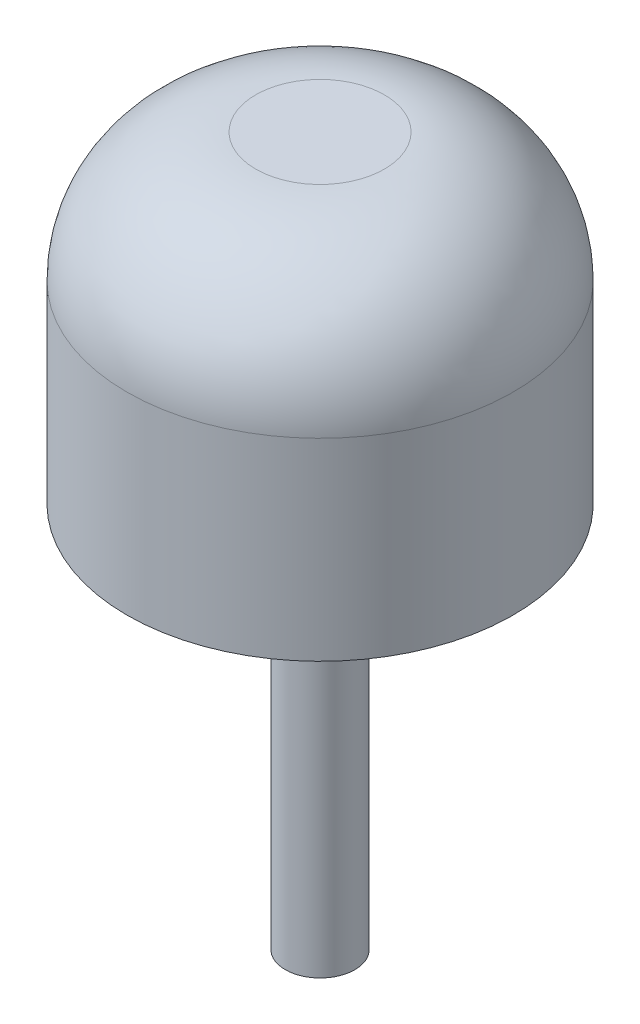
ISO-10303-21;
HEADER;
FILE_DESCRIPTION(('STEP AP214'),'2;1');
FILE_NAME('part.step','',(''),(''),'','','');
FILE_SCHEMA(('AUTOMOTIVE_DESIGN { 1 0 10303 214 1 1 1 1 }'));
ENDSEC;
DATA;
#1=APPLICATION_CONTEXT('core data for automotive mechanical design processes');
#2=APPLICATION_PROTOCOL_DEFINITION('international standard','automotive_design',2000,#1);
#3=PRODUCT_CONTEXT('',#1,'mechanical');
#4=PRODUCT('Part','Part','',(#3));
#5=PRODUCT_RELATED_PRODUCT_CATEGORY('part','',(#4));
#6=PRODUCT_DEFINITION_FORMATION('','',#4);
#7=PRODUCT_DEFINITION_CONTEXT('part definition',#1,'design');
#8=PRODUCT_DEFINITION('design','',#6,#7);
#9=PRODUCT_DEFINITION_SHAPE('','',#8);
#10=(LENGTH_UNIT() NAMED_UNIT(*) SI_UNIT(.MILLI.,.METRE.));
#11=(NAMED_UNIT(*) PLANE_ANGLE_UNIT() SI_UNIT($,.RADIAN.));
#12=(NAMED_UNIT(*) SI_UNIT($,.STERADIAN.) SOLID_ANGLE_UNIT());
#13=UNCERTAINTY_MEASURE_WITH_UNIT(LENGTH_MEASURE(1.E-05),#10,'distance_accuracy_value','');
#14=(GEOMETRIC_REPRESENTATION_CONTEXT(3) GLOBAL_UNCERTAINTY_ASSIGNED_CONTEXT((#13)) GLOBAL_UNIT_ASSIGNED_CONTEXT((#10,
#11,#12)) REPRESENTATION_CONTEXT('',''));
#15=CARTESIAN_POINT('',(0.,0.,0.));
#16=DIRECTION('',(0.,0.,1.));
#17=DIRECTION('',(1.,0.,0.));
#18=AXIS2_PLACEMENT_3D('',#15,#16,#17);
#19=CARTESIAN_POINT('',(0.,6.35,0.));
#20=DIRECTION('',(0.,-1.,0.));
#21=DIRECTION('',(0.,0.,-1.));
#22=AXIS2_PLACEMENT_3D('',#19,#20,#21);
#23=CYLINDRICAL_SURFACE('',#22,3.81);
#24=CARTESIAN_POINT('',(0.,3.81,0.));
#25=DIRECTION('',(0.,1.,0.));
#26=DIRECTION('',(0.,0.,1.));
#27=AXIS2_PLACEMENT_3D('',#24,#25,#26);
#28=CIRCLE('',#27,3.81);
#29=CARTESIAN_POINT('',(0.,3.81,3.81));
#30=VERTEX_POINT('',#29);
#31=EDGE_CURVE('E10',#30,#30,#28,.F.);
#32=ORIENTED_EDGE('',*,*,#31,.T.);
#33=EDGE_LOOP('',(#32));
#34=FACE_BOUND('',#33,.T.);
#35=CARTESIAN_POINT('',(0.,0.,0.));
#36=DIRECTION('',(0.,1.,0.));
#37=DIRECTION('',(0.,0.,1.));
#38=AXIS2_PLACEMENT_3D('',#35,#36,#37);
#39=CIRCLE('',#38,3.81);
#40=CARTESIAN_POINT('',(0.,0.,3.81));
#41=VERTEX_POINT('',#40);
#42=EDGE_CURVE('E46',#41,#41,#39,.T.);
#43=ORIENTED_EDGE('',*,*,#42,.T.);
#44=EDGE_LOOP('',(#43));
#45=FACE_BOUND('',#44,.T.);
#46=ADVANCED_FACE('F31',(#34,#45),#23,.T.);
#47=CARTESIAN_POINT('',(0.,6.35,0.));
#48=DIRECTION('',(0.,1.,0.));
#49=DIRECTION('',(0.,0.,1.));
#50=AXIS2_PLACEMENT_3D('',#47,#48,#49);
#51=PLANE('',#50);
#52=CARTESIAN_POINT('',(0.,6.35,0.));
#53=DIRECTION('',(0.,1.,0.));
#54=DIRECTION('',(0.,0.,1.));
#55=AXIS2_PLACEMENT_3D('',#52,#53,#54);
#56=CIRCLE('',#55,1.27);
#57=CARTESIAN_POINT('',(0.,6.35,1.27));
#58=VERTEX_POINT('',#57);
#59=EDGE_CURVE('E38',#58,#58,#56,.T.);
#60=ORIENTED_EDGE('',*,*,#59,.T.);
#61=EDGE_LOOP('',(#60));
#62=FACE_BOUND('',#61,.T.);
#63=ADVANCED_FACE('F66',(#62),#51,.T.);
#64=CARTESIAN_POINT('',(0.,0.,0.));
#65=DIRECTION('',(0.,1.,0.));
#66=DIRECTION('',(0.,0.,1.));
#67=AXIS2_PLACEMENT_3D('',#64,#65,#66);
#68=PLANE('',#67);
#69=CARTESIAN_POINT('',(0.,0.,0.));
#70=DIRECTION('',(0.,1.,0.));
#71=DIRECTION('',(0.,0.,1.));
#72=AXIS2_PLACEMENT_3D('',#69,#70,#71);
#73=CIRCLE('',#72,0.6858);
#74=CARTESIAN_POINT('',(0.,0.,0.6858));
#75=VERTEX_POINT('',#74);
#76=EDGE_CURVE('E42',#75,#75,#73,.F.);
#77=ORIENTED_EDGE('',*,*,#76,.F.);
#78=EDGE_LOOP('',(#77));
#79=FACE_BOUND('',#78,.T.);
#80=ORIENTED_EDGE('',*,*,#42,.F.);
#81=EDGE_LOOP('',(#80));
#82=FACE_BOUND('',#81,.T.);
#83=ADVANCED_FACE('F60',(#79,#82),#68,.F.);
#84=CARTESIAN_POINT('',(0.,-7.62,0.));
#85=DIRECTION('',(0.,1.,0.));
#86=DIRECTION('',(0.,0.,1.));
#87=AXIS2_PLACEMENT_3D('',#84,#85,#86);
#88=CYLINDRICAL_SURFACE('',#87,0.6858);
#89=CARTESIAN_POINT('',(0.,-7.62,0.));
#90=DIRECTION('',(0.,-1.,0.));
#91=DIRECTION('',(0.,0.,-1.));
#92=AXIS2_PLACEMENT_3D('',#89,#90,#91);
#93=CIRCLE('',#92,0.6858);
#94=CARTESIAN_POINT('',(0.,-7.62,-0.6858));
#95=VERTEX_POINT('',#94);
#96=EDGE_CURVE('E51',#95,#95,#93,.T.);
#97=ORIENTED_EDGE('',*,*,#96,.F.);
#98=EDGE_LOOP('',(#97));
#99=FACE_BOUND('',#98,.T.);
#100=ORIENTED_EDGE('',*,*,#76,.T.);
#101=EDGE_LOOP('',(#100));
#102=FACE_BOUND('',#101,.T.);
#103=ADVANCED_FACE('F57',(#99,#102),#88,.T.);
#104=CARTESIAN_POINT('',(0.,-7.62,0.));
#105=DIRECTION('',(0.,-1.,0.));
#106=DIRECTION('',(0.,0.,-1.));
#107=AXIS2_PLACEMENT_3D('',#104,#105,#106);
#108=PLANE('',#107);
#109=ORIENTED_EDGE('',*,*,#96,.T.);
#110=EDGE_LOOP('',(#109));
#111=FACE_BOUND('',#110,.T.);
#112=ADVANCED_FACE('F55',(#111),#108,.T.);
#113=CARTESIAN_POINT('',(0.,3.81,0.));
#114=DIRECTION('',(0.,1.,0.));
#115=DIRECTION('',(0.,0.,1.));
#116=AXIS2_PLACEMENT_3D('',#113,#114,#115);
#117=DEGENERATE_TOROIDAL_SURFACE('',#116,1.27,2.54,.T.);
#118=ORIENTED_EDGE('',*,*,#31,.F.);
#119=EDGE_LOOP('',(#118));
#120=FACE_BOUND('',#119,.T.);
#121=ORIENTED_EDGE('',*,*,#59,.F.);
#122=EDGE_LOOP('',(#121));
#123=FACE_BOUND('',#122,.T.);
#124=ADVANCED_FACE('F33',(#120,#123),#117,.T.);
#125=CLOSED_SHELL('',(#46,#63,#83,#103,#112,#124));
#126=MANIFOLD_SOLID_BREP('B2',#125);
#127=ADVANCED_BREP_SHAPE_REPRESENTATION('',(#18,#126),#14);
#128=SHAPE_DEFINITION_REPRESENTATION(#9,#127);
ENDSEC;
END-ISO-10303-21;
